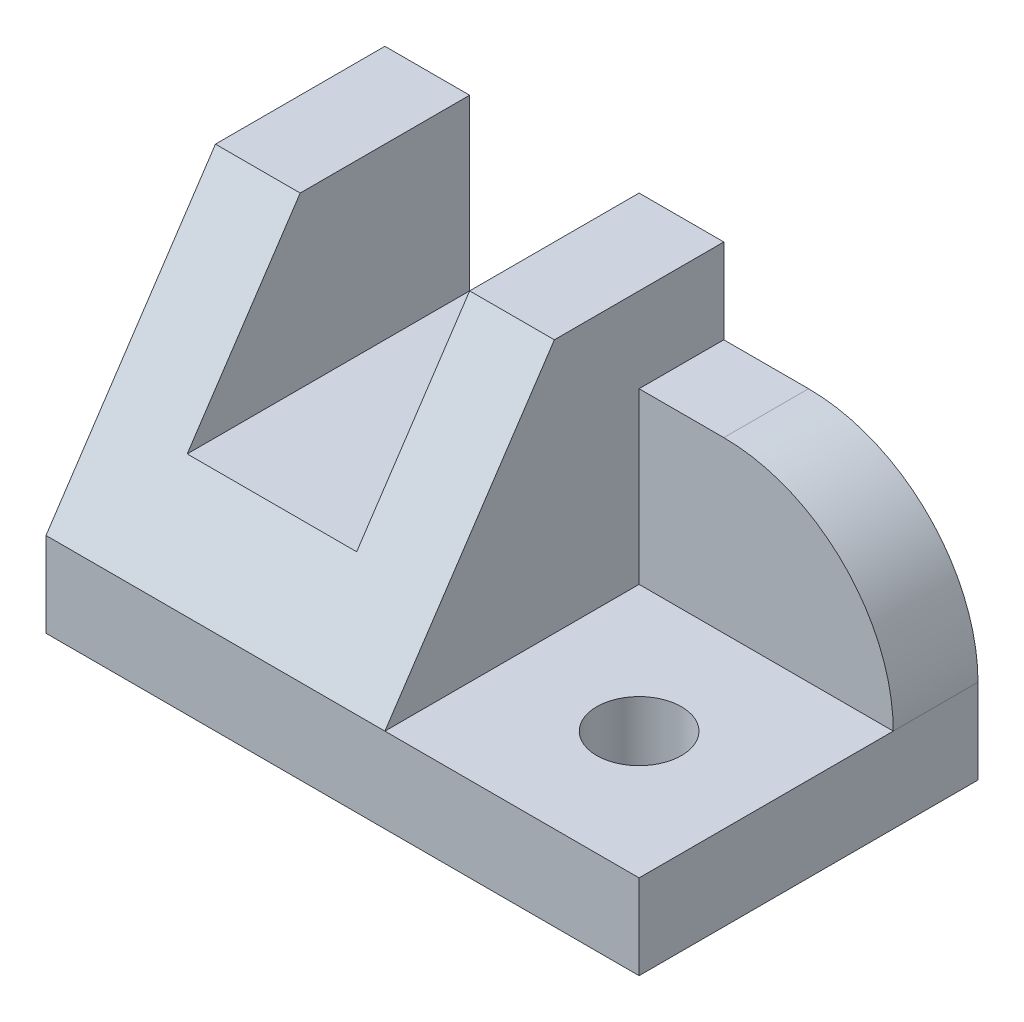
ISO-10303-21;
HEADER;
FILE_DESCRIPTION(('STEP AP214'),'2;1');
FILE_NAME('part.step','',(''),(''),'','','');
FILE_SCHEMA(('AUTOMOTIVE_DESIGN { 1 0 10303 214 1 1 1 1 }'));
ENDSEC;
DATA;
#1=APPLICATION_CONTEXT('core data for automotive mechanical design processes');
#2=APPLICATION_PROTOCOL_DEFINITION('international standard','automotive_design',2000,#1);
#3=PRODUCT_CONTEXT('',#1,'mechanical');
#4=PRODUCT('Part','Part','',(#3));
#5=PRODUCT_RELATED_PRODUCT_CATEGORY('part','',(#4));
#6=PRODUCT_DEFINITION_FORMATION('','',#4);
#7=PRODUCT_DEFINITION_CONTEXT('part definition',#1,'design');
#8=PRODUCT_DEFINITION('design','',#6,#7);
#9=PRODUCT_DEFINITION_SHAPE('','',#8);
#10=(LENGTH_UNIT() NAMED_UNIT(*) SI_UNIT(.MILLI.,.METRE.));
#11=(NAMED_UNIT(*) PLANE_ANGLE_UNIT() SI_UNIT($,.RADIAN.));
#12=(NAMED_UNIT(*) SI_UNIT($,.STERADIAN.) SOLID_ANGLE_UNIT());
#13=UNCERTAINTY_MEASURE_WITH_UNIT(LENGTH_MEASURE(1.E-05),#10,'distance_accuracy_value','');
#14=(GEOMETRIC_REPRESENTATION_CONTEXT(3) GLOBAL_UNCERTAINTY_ASSIGNED_CONTEXT((#13)) GLOBAL_UNIT_ASSIGNED_CONTEXT((#10,
#11,#12)) REPRESENTATION_CONTEXT('',''));
#15=CARTESIAN_POINT('',(0.,0.,0.));
#16=DIRECTION('',(0.,0.,1.));
#17=DIRECTION('',(1.,0.,0.));
#18=AXIS2_PLACEMENT_3D('',#15,#16,#17);
#19=CARTESIAN_POINT('',(-2.09339488942264,9.29069673517625,-1.19885004433804));
#20=DIRECTION('',(0.,1.,0.));
#21=DIRECTION('',(0.,0.,1.));
#22=AXIS2_PLACEMENT_3D('',#19,#20,#21);
#23=PLANE('',#22);
#24=DIRECTION('',(0.,0.,-1.));
#25=VECTOR('',#24,1.);
#26=CARTESIAN_POINT('',(-2.59339488942264,9.29069673517625,0.801149955661958));
#27=LINE('',#26,#25);
#28=CARTESIAN_POINT('',(-2.59339488942264,9.29069673517625,-1.19885004433804));
#29=VERTEX_POINT('',#28);
#30=CARTESIAN_POINT('',(-2.59339488942264,9.29069673517625,-3.19885004433804));
#31=VERTEX_POINT('',#30);
#32=EDGE_CURVE('E149',#29,#31,#27,.T.);
#33=ORIENTED_EDGE('',*,*,#32,.F.);
#34=DIRECTION('',(1.,0.,0.));
#35=VECTOR('',#34,1.);
#36=CARTESIAN_POINT('',(-5.59339488942264,9.29069673517625,-1.19885004433804));
#37=LINE('',#36,#35);
#38=CARTESIAN_POINT('',(-1.59339488942264,9.29069673517625,-1.19885004433804));
#39=VERTEX_POINT('',#38);
#40=EDGE_CURVE('E173',#29,#39,#37,.T.);
#41=ORIENTED_EDGE('',*,*,#40,.T.);
#42=DIRECTION('',(0.,0.,1.));
#43=VECTOR('',#42,1.);
#44=CARTESIAN_POINT('',(-1.59339488942264,9.29069673517625,-1.19885004433804));
#45=LINE('',#44,#43);
#46=CARTESIAN_POINT('',(-1.59339488942264,9.29069673517625,-3.19885004433804));
#47=VERTEX_POINT('',#46);
#48=EDGE_CURVE('E175',#47,#39,#45,.T.);
#49=ORIENTED_EDGE('',*,*,#48,.F.);
#50=DIRECTION('',(1.,0.,0.));
#51=VECTOR('',#50,1.);
#52=CARTESIAN_POINT('',(-2.09339488942264,9.29069673517625,-3.19885004433804));
#53=LINE('',#52,#51);
#54=EDGE_CURVE('E178',#31,#47,#53,.T.);
#55=ORIENTED_EDGE('',*,*,#54,.F.);
#56=EDGE_LOOP('',(#33,#41,#49,#55));
#57=FACE_BOUND('',#56,.T.);
#58=ADVANCED_FACE('F38',(#57),#23,.T.);
#59=CARTESIAN_POINT('',(-2.09339488942264,6.29069673517625,0.801149955661958));
#60=DIRECTION('',(0.,0.,-1.));
#61=DIRECTION('',(-1.,0.,0.));
#62=AXIS2_PLACEMENT_3D('',#59,#60,#61);
#63=PLANE('',#62);
#64=DIRECTION('',(1.,0.,0.));
#65=VECTOR('',#64,1.);
#66=CARTESIAN_POINT('',(-2.09339488942264,6.29069673517625,0.801149955661958));
#67=LINE('',#66,#65);
#68=CARTESIAN_POINT('',(-1.59339488942264,6.29069673517625,0.801149955661958));
#69=VERTEX_POINT('',#68);
#70=CARTESIAN_POINT('',(1.40660511057736,6.29069673517625,0.801149955661958));
#71=VERTEX_POINT('',#70);
#72=EDGE_CURVE('E220',#69,#71,#67,.T.);
#73=ORIENTED_EDGE('',*,*,#72,.F.);
#74=DIRECTION('',(1.,0.,0.));
#75=VECTOR('',#74,1.);
#76=CARTESIAN_POINT('',(-5.59339488942264,6.29069673517625,0.801149955661958));
#77=LINE('',#76,#75);
#78=CARTESIAN_POINT('',(-5.59339488942264,6.29069673517625,0.801149955661958));
#79=VERTEX_POINT('',#78);
#80=EDGE_CURVE('E166',#79,#69,#77,.T.);
#81=ORIENTED_EDGE('',*,*,#80,.F.);
#82=DIRECTION('',(0.,-1.,0.));
#83=VECTOR('',#82,1.);
#84=CARTESIAN_POINT('',(-5.59339488942264,9.29069673517625,0.801149955661958));
#85=LINE('',#84,#83);
#86=CARTESIAN_POINT('',(-5.59339488942264,5.29069673517625,0.801149955661958));
#87=VERTEX_POINT('',#86);
#88=EDGE_CURVE('E183',#79,#87,#85,.T.);
#89=ORIENTED_EDGE('',*,*,#88,.T.);
#90=DIRECTION('',(1.,0.,0.));
#91=VECTOR('',#90,1.);
#92=CARTESIAN_POINT('',(-2.09339488942264,5.29069673517625,0.801149955661958));
#93=LINE('',#92,#91);
#94=CARTESIAN_POINT('',(1.40660511057736,5.29069673517625,0.801149955661958));
#95=VERTEX_POINT('',#94);
#96=EDGE_CURVE('E229',#87,#95,#93,.T.);
#97=ORIENTED_EDGE('',*,*,#96,.T.);
#98=DIRECTION('',(0.,-1.,0.));
#99=VECTOR('',#98,1.);
#100=CARTESIAN_POINT('',(1.40660511057736,6.29069673517625,0.801149955661958));
#101=LINE('',#100,#99);
#102=EDGE_CURVE('E226',#71,#95,#101,.T.);
#103=ORIENTED_EDGE('',*,*,#102,.F.);
#104=EDGE_LOOP('',(#73,#81,#89,#97,#103));
#105=FACE_BOUND('',#104,.T.);
#106=ADVANCED_FACE('F269',(#105),#63,.F.);
#107=CARTESIAN_POINT('',(-0.0933948894226384,6.29069673517625,-0.698850044338042));
#108=DIRECTION('',(0.,-1.,0.));
#109=DIRECTION('',(0.,0.,-1.));
#110=AXIS2_PLACEMENT_3D('',#107,#108,#109);
#111=CYLINDRICAL_SURFACE('',#110,0.5);
#112=CARTESIAN_POINT('',(-0.0933948894226384,6.29069673517625,-0.698850044338042));
#113=DIRECTION('',(0.,1.,0.));
#114=DIRECTION('',(0.,0.,1.));
#115=AXIS2_PLACEMENT_3D('',#112,#113,#114);
#116=CIRCLE('',#115,0.5);
#117=CARTESIAN_POINT('',(-0.0933948894226384,6.29069673517625,-0.198850044338042));
#118=VERTEX_POINT('',#117);
#119=EDGE_CURVE('E210',#118,#118,#116,.T.);
#120=ORIENTED_EDGE('',*,*,#119,.T.);
#121=EDGE_LOOP('',(#120));
#122=FACE_BOUND('',#121,.T.);
#123=CARTESIAN_POINT('',(-0.0933948894226384,5.29069673517625,-0.698850044338042));
#124=DIRECTION('',(0.,1.,0.));
#125=DIRECTION('',(0.,0.,1.));
#126=AXIS2_PLACEMENT_3D('',#123,#124,#125);
#127=CIRCLE('',#126,0.5);
#128=CARTESIAN_POINT('',(-0.0933948894226384,5.29069673517625,-0.198850044338042));
#129=VERTEX_POINT('',#128);
#130=EDGE_CURVE('E209',#129,#129,#127,.T.);
#131=ORIENTED_EDGE('',*,*,#130,.F.);
#132=EDGE_LOOP('',(#131));
#133=FACE_BOUND('',#132,.T.);
#134=ADVANCED_FACE('F298',(#122,#133),#111,.F.);
#135=CARTESIAN_POINT('',(1.40660511057736,6.29069673517625,-1.19885004433804));
#136=DIRECTION('',(-1.,0.,0.));
#137=DIRECTION('',(0.,0.,1.));
#138=AXIS2_PLACEMENT_3D('',#135,#136,#137);
#139=PLANE('',#138);
#140=DIRECTION('',(0.,-1.,0.));
#141=VECTOR('',#140,1.);
#142=CARTESIAN_POINT('',(1.40660511057736,8.29069673517624,-3.19885004433804));
#143=LINE('',#142,#141);
#144=CARTESIAN_POINT('',(1.40660511057736,6.29069673517625,-3.19885004433804));
#145=VERTEX_POINT('',#144);
#146=CARTESIAN_POINT('',(1.40660511057736,5.29069673517625,-3.19885004433804));
#147=VERTEX_POINT('',#146);
#148=EDGE_CURVE('E202',#145,#147,#143,.T.);
#149=ORIENTED_EDGE('',*,*,#148,.F.);
#150=DIRECTION('',(0.,0.,-1.));
#151=VECTOR('',#150,1.);
#152=CARTESIAN_POINT('',(1.40660511057736,6.29069673517625,-2.19885004433804));
#153=LINE('',#152,#151);
#154=CARTESIAN_POINT('',(1.40660511057736,6.29069673517625,-2.19885004433804));
#155=VERTEX_POINT('',#154);
#156=EDGE_CURVE('E46',#145,#155,#153,.F.);
#157=ORIENTED_EDGE('',*,*,#156,.T.);
#158=DIRECTION('',(0.,0.,-1.));
#159=VECTOR('',#158,1.);
#160=CARTESIAN_POINT('',(1.40660511057736,6.29069673517625,-1.19885004433804));
#161=LINE('',#160,#159);
#162=EDGE_CURVE('E223',#71,#155,#161,.T.);
#163=ORIENTED_EDGE('',*,*,#162,.F.);
#164=ORIENTED_EDGE('',*,*,#102,.T.);
#165=DIRECTION('',(0.,0.,-1.));
#166=VECTOR('',#165,1.);
#167=CARTESIAN_POINT('',(1.40660511057736,5.29069673517625,-1.19885004433804));
#168=LINE('',#167,#166);
#169=EDGE_CURVE('E214',#95,#147,#168,.T.);
#170=ORIENTED_EDGE('',*,*,#169,.T.);
#171=EDGE_LOOP('',(#149,#157,#163,#164,#170));
#172=FACE_BOUND('',#171,.T.);
#173=ADVANCED_FACE('F245',(#172),#139,.F.);
#174=CARTESIAN_POINT('',(-2.09339488942264,6.29069673517625,-1.19885004433804));
#175=DIRECTION('',(0.,1.,0.));
#176=DIRECTION('',(0.,0.,1.));
#177=AXIS2_PLACEMENT_3D('',#174,#175,#176);
#178=PLANE('',#177);
#179=ORIENTED_EDGE('',*,*,#119,.F.);
#180=EDGE_LOOP('',(#179));
#181=FACE_BOUND('',#180,.T.);
#182=DIRECTION('',(1.,0.,0.));
#183=VECTOR('',#182,1.);
#184=CARTESIAN_POINT('',(-2.09339488942264,6.29069673517625,-2.19885004433804));
#185=LINE('',#184,#183);
#186=CARTESIAN_POINT('',(-1.59339488942264,6.29069673517625,-2.19885004433804));
#187=VERTEX_POINT('',#186);
#188=EDGE_CURVE('E213',#187,#155,#185,.T.);
#189=ORIENTED_EDGE('',*,*,#188,.F.);
#190=DIRECTION('',(0.,0.,1.));
#191=VECTOR('',#190,1.);
#192=CARTESIAN_POINT('',(-1.59339488942264,6.29069673517625,-1.19885004433804));
#193=LINE('',#192,#191);
#194=EDGE_CURVE('E217',#187,#69,#193,.T.);
#195=ORIENTED_EDGE('',*,*,#194,.T.);
#196=ORIENTED_EDGE('',*,*,#72,.T.);
#197=ORIENTED_EDGE('',*,*,#162,.T.);
#198=EDGE_LOOP('',(#189,#195,#196,#197));
#199=FACE_BOUND('',#198,.T.);
#200=ADVANCED_FACE('F249',(#181,#199),#178,.T.);
#201=CARTESIAN_POINT('',(-2.09339488942264,5.29069673517625,-1.19885004433804));
#202=DIRECTION('',(0.,1.,0.));
#203=DIRECTION('',(0.,0.,1.));
#204=AXIS2_PLACEMENT_3D('',#201,#202,#203);
#205=PLANE('',#204);
#206=ORIENTED_EDGE('',*,*,#130,.T.);
#207=EDGE_LOOP('',(#206));
#208=FACE_BOUND('',#207,.T.);
#209=ORIENTED_EDGE('',*,*,#96,.F.);
#210=DIRECTION('',(0.,0.,-1.));
#211=VECTOR('',#210,1.);
#212=CARTESIAN_POINT('',(-5.59339488942264,5.29069673517625,-1.19885004433804));
#213=LINE('',#212,#211);
#214=CARTESIAN_POINT('',(-5.59339488942264,5.29069673517625,-3.19885004433804));
#215=VERTEX_POINT('',#214);
#216=EDGE_CURVE('E172',#87,#215,#213,.T.);
#217=ORIENTED_EDGE('',*,*,#216,.T.);
#218=DIRECTION('',(1.,0.,0.));
#219=VECTOR('',#218,1.);
#220=CARTESIAN_POINT('',(-2.09339488942264,5.29069673517625,-3.19885004433804));
#221=LINE('',#220,#219);
#222=EDGE_CURVE('E193',#215,#147,#221,.T.);
#223=ORIENTED_EDGE('',*,*,#222,.T.);
#224=ORIENTED_EDGE('',*,*,#169,.F.);
#225=EDGE_LOOP('',(#209,#217,#223,#224));
#226=FACE_BOUND('',#225,.T.);
#227=ADVANCED_FACE('F273',(#208,#226),#205,.F.);
#228=CARTESIAN_POINT('',(-2.09339488942264,8.29069673517624,-2.19885004433804));
#229=DIRECTION('',(0.,0.,-1.));
#230=DIRECTION('',(-1.,0.,0.));
#231=AXIS2_PLACEMENT_3D('',#228,#229,#230);
#232=PLANE('',#231);
#233=ORIENTED_EDGE('',*,*,#188,.T.);
#234=CARTESIAN_POINT('',(-0.593394889422639,6.29069673517625,-2.19885004433804));
#235=DIRECTION('',(0.,0.,-1.));
#236=DIRECTION('',(-1.,0.,0.));
#237=AXIS2_PLACEMENT_3D('',#234,#235,#236);
#238=CIRCLE('',#237,2.);
#239=CARTESIAN_POINT('',(-0.593394889422639,8.29069673517624,-2.19885004433804));
#240=VERTEX_POINT('',#239);
#241=EDGE_CURVE('E11',#155,#240,#238,.F.);
#242=ORIENTED_EDGE('',*,*,#241,.T.);
#243=DIRECTION('',(1.,0.,0.));
#244=VECTOR('',#243,1.);
#245=CARTESIAN_POINT('',(-2.09339488942264,8.29069673517624,-2.19885004433804));
#246=LINE('',#245,#244);
#247=CARTESIAN_POINT('',(-1.59339488942264,8.29069673517624,-2.19885004433804));
#248=VERTEX_POINT('',#247);
#249=EDGE_CURVE('E197',#248,#240,#246,.T.);
#250=ORIENTED_EDGE('',*,*,#249,.F.);
#251=DIRECTION('',(0.,-1.,0.));
#252=VECTOR('',#251,1.);
#253=CARTESIAN_POINT('',(-1.59339488942264,8.29069673517624,-2.19885004433804));
#254=LINE('',#253,#252);
#255=EDGE_CURVE('E206',#248,#187,#254,.T.);
#256=ORIENTED_EDGE('',*,*,#255,.T.);
#257=EDGE_LOOP('',(#233,#242,#250,#256));
#258=FACE_BOUND('',#257,.T.);
#259=ADVANCED_FACE('F253',(#258),#232,.F.);
#260=CARTESIAN_POINT('',(-2.09339488942264,8.29069673517624,-3.19885004433804));
#261=DIRECTION('',(0.,0.,-1.));
#262=DIRECTION('',(-1.,0.,0.));
#263=AXIS2_PLACEMENT_3D('',#260,#261,#262);
#264=PLANE('',#263);
#265=DIRECTION('',(1.,0.,0.));
#266=VECTOR('',#265,1.);
#267=CARTESIAN_POINT('',(-2.09339488942264,8.29069673517624,-3.19885004433804));
#268=LINE('',#267,#266);
#269=CARTESIAN_POINT('',(-1.59339488942264,8.29069673517624,-3.19885004433804));
#270=VERTEX_POINT('',#269);
#271=CARTESIAN_POINT('',(-0.593394889422639,8.29069673517624,-3.19885004433804));
#272=VERTEX_POINT('',#271);
#273=EDGE_CURVE('E200',#270,#272,#268,.T.);
#274=ORIENTED_EDGE('',*,*,#273,.T.);
#275=CARTESIAN_POINT('',(-0.593394889422639,6.29069673517625,-3.19885004433804));
#276=DIRECTION('',(0.,0.,-1.));
#277=DIRECTION('',(-1.,0.,0.));
#278=AXIS2_PLACEMENT_3D('',#275,#276,#277);
#279=CIRCLE('',#278,2.);
#280=EDGE_CURVE('E53',#272,#145,#279,.T.);
#281=ORIENTED_EDGE('',*,*,#280,.T.);
#282=ORIENTED_EDGE('',*,*,#148,.T.);
#283=ORIENTED_EDGE('',*,*,#222,.F.);
#284=DIRECTION('',(0.,-1.,0.));
#285=VECTOR('',#284,1.);
#286=CARTESIAN_POINT('',(-5.59339488942264,9.29069673517625,-3.19885004433804));
#287=LINE('',#286,#285);
#288=CARTESIAN_POINT('',(-5.59339488942264,9.29069673517625,-3.19885004433804));
#289=VERTEX_POINT('',#288);
#290=EDGE_CURVE('E187',#289,#215,#287,.T.);
#291=ORIENTED_EDGE('',*,*,#290,.F.);
#292=CARTESIAN_POINT('',(-4.59339488942264,9.29069673517625,-3.19885004433804));
#293=VERTEX_POINT('',#292);
#294=EDGE_CURVE('E179',#289,#293,#53,.T.);
#295=ORIENTED_EDGE('',*,*,#294,.T.);
#296=DIRECTION('',(0.,1.,0.));
#297=VECTOR('',#296,1.);
#298=CARTESIAN_POINT('',(-4.59339488942264,9.29069673517625,-3.19885004433804));
#299=LINE('',#298,#297);
#300=CARTESIAN_POINT('',(-4.59339488942264,7.29069673517625,-3.19885004433804));
#301=VERTEX_POINT('',#300);
#302=EDGE_CURVE('E143',#301,#293,#299,.T.);
#303=ORIENTED_EDGE('',*,*,#302,.F.);
#304=DIRECTION('',(-1.,0.,0.));
#305=VECTOR('',#304,1.);
#306=CARTESIAN_POINT('',(-2.59339488942264,7.29069673517625,-3.19885004433804));
#307=LINE('',#306,#305);
#308=CARTESIAN_POINT('',(-2.59339488942264,7.29069673517625,-3.19885004433804));
#309=VERTEX_POINT('',#308);
#310=EDGE_CURVE('E136',#309,#301,#307,.T.);
#311=ORIENTED_EDGE('',*,*,#310,.F.);
#312=DIRECTION('',(0.,-1.,0.));
#313=VECTOR('',#312,1.);
#314=CARTESIAN_POINT('',(-2.59339488942264,9.29069673517625,-3.19885004433804));
#315=LINE('',#314,#313);
#316=EDGE_CURVE('E146',#31,#309,#315,.T.);
#317=ORIENTED_EDGE('',*,*,#316,.F.);
#318=ORIENTED_EDGE('',*,*,#54,.T.);
#319=DIRECTION('',(0.,-1.,0.));
#320=VECTOR('',#319,1.);
#321=CARTESIAN_POINT('',(-1.59339488942264,9.29069673517625,-3.19885004433804));
#322=LINE('',#321,#320);
#323=EDGE_CURVE('E190',#47,#270,#322,.T.);
#324=ORIENTED_EDGE('',*,*,#323,.T.);
#325=EDGE_LOOP('',(#274,#281,#282,#283,#291,#295,#303,#311,#317,#318,#324));
#326=FACE_BOUND('',#325,.T.);
#327=ADVANCED_FACE('F152',(#326),#264,.T.);
#328=CARTESIAN_POINT('',(-2.09339488942264,8.29069673517624,-1.19885004433804));
#329=DIRECTION('',(0.,1.,0.));
#330=DIRECTION('',(0.,0.,1.));
#331=AXIS2_PLACEMENT_3D('',#328,#329,#330);
#332=PLANE('',#331);
#333=ORIENTED_EDGE('',*,*,#249,.T.);
#334=DIRECTION('',(0.,0.,-1.));
#335=VECTOR('',#334,1.);
#336=CARTESIAN_POINT('',(-0.593394889422639,8.29069673517624,-3.19885004433804));
#337=LINE('',#336,#335);
#338=EDGE_CURVE('E242',#240,#272,#337,.T.);
#339=ORIENTED_EDGE('',*,*,#338,.T.);
#340=ORIENTED_EDGE('',*,*,#273,.F.);
#341=DIRECTION('',(0.,0.,1.));
#342=VECTOR('',#341,1.);
#343=CARTESIAN_POINT('',(-1.59339488942264,8.29069673517624,-1.19885004433804));
#344=LINE('',#343,#342);
#345=EDGE_CURVE('E194',#270,#248,#344,.T.);
#346=ORIENTED_EDGE('',*,*,#345,.T.);
#347=EDGE_LOOP('',(#333,#339,#340,#346));
#348=FACE_BOUND('',#347,.T.);
#349=ADVANCED_FACE('F257',(#348),#332,.T.);
#350=CARTESIAN_POINT('',(-1.59339488942264,9.29069673517625,-1.19885004433804));
#351=DIRECTION('',(1.,0.,0.));
#352=DIRECTION('',(0.,0.,-1.));
#353=AXIS2_PLACEMENT_3D('',#350,#351,#352);
#354=PLANE('',#353);
#355=DIRECTION('',(0.,0.832050294337844,-0.554700196225229));
#356=VECTOR('',#355,1.);
#357=CARTESIAN_POINT('',(-1.59339488942264,6.29069673517625,0.801149955661958));
#358=LINE('',#357,#356);
#359=EDGE_CURVE('E158',#69,#39,#358,.T.);
#360=ORIENTED_EDGE('',*,*,#359,.F.);
#361=ORIENTED_EDGE('',*,*,#194,.F.);
#362=ORIENTED_EDGE('',*,*,#255,.F.);
#363=ORIENTED_EDGE('',*,*,#345,.F.);
#364=ORIENTED_EDGE('',*,*,#323,.F.);
#365=ORIENTED_EDGE('',*,*,#48,.T.);
#366=EDGE_LOOP('',(#360,#361,#362,#363,#364,#365));
#367=FACE_BOUND('',#366,.T.);
#368=ADVANCED_FACE('F262',(#367),#354,.T.);
#369=CARTESIAN_POINT('',(-5.59339488942264,9.29069673517625,-1.19885004433804));
#370=DIRECTION('',(-1.,0.,0.));
#371=DIRECTION('',(0.,0.,1.));
#372=AXIS2_PLACEMENT_3D('',#369,#370,#371);
#373=PLANE('',#372);
#374=DIRECTION('',(0.,0.832050294337844,-0.554700196225229));
#375=VECTOR('',#374,1.);
#376=CARTESIAN_POINT('',(-5.59339488942264,6.29069673517625,0.801149955661958));
#377=LINE('',#376,#375);
#378=CARTESIAN_POINT('',(-5.59339488942264,9.29069673517625,-1.19885004433804));
#379=VERTEX_POINT('',#378);
#380=EDGE_CURVE('E163',#79,#379,#377,.T.);
#381=ORIENTED_EDGE('',*,*,#380,.T.);
#382=DIRECTION('',(0.,0.,-1.));
#383=VECTOR('',#382,1.);
#384=CARTESIAN_POINT('',(-5.59339488942264,9.29069673517625,-1.19885004433804));
#385=LINE('',#384,#383);
#386=EDGE_CURVE('E181',#379,#289,#385,.T.);
#387=ORIENTED_EDGE('',*,*,#386,.T.);
#388=ORIENTED_EDGE('',*,*,#290,.T.);
#389=ORIENTED_EDGE('',*,*,#216,.F.);
#390=ORIENTED_EDGE('',*,*,#88,.F.);
#391=EDGE_LOOP('',(#381,#387,#388,#389,#390));
#392=FACE_BOUND('',#391,.T.);
#393=ADVANCED_FACE('F278',(#392),#373,.T.);
#394=DIRECTION('',(0.,0.,-1.));
#395=VECTOR('',#394,1.);
#396=CARTESIAN_POINT('',(-4.59339488942264,9.29069673517625,0.801149955661958));
#397=LINE('',#396,#395);
#398=CARTESIAN_POINT('',(-4.59339488942264,9.29069673517625,-1.19885004433804));
#399=VERTEX_POINT('',#398);
#400=EDGE_CURVE('E159',#399,#293,#397,.T.);
#401=ORIENTED_EDGE('',*,*,#400,.T.);
#402=ORIENTED_EDGE('',*,*,#294,.F.);
#403=ORIENTED_EDGE('',*,*,#386,.F.);
#404=EDGE_CURVE('E169',#379,#399,#37,.T.);
#405=ORIENTED_EDGE('',*,*,#404,.T.);
#406=EDGE_LOOP('',(#401,#402,#403,#405));
#407=FACE_BOUND('',#406,.T.);
#408=ADVANCED_FACE('F281',(#407),#23,.T.);
#409=CARTESIAN_POINT('',(-5.59339488942264,6.29069673517625,0.801149955661958));
#410=DIRECTION('',(0.,-0.554700196225229,-0.832050294337844));
#411=DIRECTION('',(0.,0.832050294337844,-0.554700196225229));
#412=AXIS2_PLACEMENT_3D('',#409,#410,#411);
#413=PLANE('',#412);
#414=ORIENTED_EDGE('',*,*,#40,.F.);
#415=DIRECTION('',(0.,-0.832050294337844,0.554700196225229));
#416=VECTOR('',#415,1.);
#417=CARTESIAN_POINT('',(-2.59339488942264,6.29069673517625,0.801149955661958));
#418=LINE('',#417,#416);
#419=CARTESIAN_POINT('',(-2.59339488942264,7.29069673517625,0.134483288995291));
#420=VERTEX_POINT('',#419);
#421=EDGE_CURVE('E240',#29,#420,#418,.T.);
#422=ORIENTED_EDGE('',*,*,#421,.T.);
#423=DIRECTION('',(-1.,0.,0.));
#424=VECTOR('',#423,1.);
#425=CARTESIAN_POINT('',(-5.59339488942264,7.29069673517625,0.134483288995291));
#426=LINE('',#425,#424);
#427=CARTESIAN_POINT('',(-4.59339488942264,7.29069673517625,0.134483288995291));
#428=VERTEX_POINT('',#427);
#429=EDGE_CURVE('E139',#420,#428,#426,.T.);
#430=ORIENTED_EDGE('',*,*,#429,.T.);
#431=DIRECTION('',(0.,0.832050294337844,-0.554700196225229));
#432=VECTOR('',#431,1.);
#433=CARTESIAN_POINT('',(-4.59339488942264,6.29069673517625,0.801149955661958));
#434=LINE('',#433,#432);
#435=EDGE_CURVE('E237',#428,#399,#434,.T.);
#436=ORIENTED_EDGE('',*,*,#435,.T.);
#437=ORIENTED_EDGE('',*,*,#404,.F.);
#438=ORIENTED_EDGE('',*,*,#380,.F.);
#439=ORIENTED_EDGE('',*,*,#80,.T.);
#440=ORIENTED_EDGE('',*,*,#359,.T.);
#441=EDGE_LOOP('',(#414,#422,#430,#436,#437,#438,#439,#440));
#442=FACE_BOUND('',#441,.T.);
#443=ADVANCED_FACE('F266',(#442),#413,.F.);
#444=CARTESIAN_POINT('',(-2.59339488942264,9.29069673517625,0.801149955661958));
#445=DIRECTION('',(1.,0.,0.));
#446=DIRECTION('',(0.,1.,0.));
#447=AXIS2_PLACEMENT_3D('',#444,#445,#446);
#448=PLANE('',#447);
#449=ORIENTED_EDGE('',*,*,#32,.T.);
#450=ORIENTED_EDGE('',*,*,#316,.T.);
#451=DIRECTION('',(0.,0.,-1.));
#452=VECTOR('',#451,1.);
#453=CARTESIAN_POINT('',(-2.59339488942264,7.29069673517625,0.801149955661958));
#454=LINE('',#453,#452);
#455=EDGE_CURVE('E132',#420,#309,#454,.T.);
#456=ORIENTED_EDGE('',*,*,#455,.F.);
#457=ORIENTED_EDGE('',*,*,#421,.F.);
#458=EDGE_LOOP('',(#449,#450,#456,#457));
#459=FACE_BOUND('',#458,.T.);
#460=ADVANCED_FACE('F147',(#459),#448,.F.);
#461=CARTESIAN_POINT('',(-4.59339488942264,9.29069673517625,0.801149955661958));
#462=DIRECTION('',(-1.,0.,0.));
#463=DIRECTION('',(0.,-1.,0.));
#464=AXIS2_PLACEMENT_3D('',#461,#462,#463);
#465=PLANE('',#464);
#466=DIRECTION('',(0.,0.,-1.));
#467=VECTOR('',#466,1.);
#468=CARTESIAN_POINT('',(-4.59339488942264,7.29069673517625,0.801149955661958));
#469=LINE('',#468,#467);
#470=EDGE_CURVE('E142',#428,#301,#469,.T.);
#471=ORIENTED_EDGE('',*,*,#470,.T.);
#472=ORIENTED_EDGE('',*,*,#302,.T.);
#473=ORIENTED_EDGE('',*,*,#400,.F.);
#474=ORIENTED_EDGE('',*,*,#435,.F.);
#475=EDGE_LOOP('',(#471,#472,#473,#474));
#476=FACE_BOUND('',#475,.T.);
#477=ADVANCED_FACE('F284',(#476),#465,.F.);
#478=CARTESIAN_POINT('',(-2.59339488942264,7.29069673517625,0.801149955661958));
#479=DIRECTION('',(0.,-1.,0.));
#480=DIRECTION('',(0.,0.,-1.));
#481=AXIS2_PLACEMENT_3D('',#478,#479,#480);
#482=PLANE('',#481);
#483=ORIENTED_EDGE('',*,*,#455,.T.);
#484=ORIENTED_EDGE('',*,*,#310,.T.);
#485=ORIENTED_EDGE('',*,*,#470,.F.);
#486=ORIENTED_EDGE('',*,*,#429,.F.);
#487=EDGE_LOOP('',(#483,#484,#485,#486));
#488=FACE_BOUND('',#487,.T.);
#489=ADVANCED_FACE('F134',(#488),#482,.F.);
#490=CARTESIAN_POINT('',(-0.593394889422639,6.29069673517625,-1.19885004433804));
#491=DIRECTION('',(0.,0.,1.));
#492=DIRECTION('',(1.,0.,0.));
#493=AXIS2_PLACEMENT_3D('',#490,#491,#492);
#494=CYLINDRICAL_SURFACE('',#493,2.);
#495=ORIENTED_EDGE('',*,*,#241,.F.);
#496=ORIENTED_EDGE('',*,*,#156,.F.);
#497=ORIENTED_EDGE('',*,*,#280,.F.);
#498=ORIENTED_EDGE('',*,*,#338,.F.);
#499=EDGE_LOOP('',(#495,#496,#497,#498));
#500=FACE_BOUND('',#499,.T.);
#501=ADVANCED_FACE('F40',(#500),#494,.T.);
#502=CLOSED_SHELL('',(#58,#106,#134,#173,#200,#227,#259,#327,#349,#368,#393,#408,#443,#460,#477,
#489,#501));
#503=MANIFOLD_SOLID_BREP('B2',#502);
#504=ADVANCED_BREP_SHAPE_REPRESENTATION('',(#18,#503),#14);
#505=SHAPE_DEFINITION_REPRESENTATION(#9,#504);
ENDSEC;
END-ISO-10303-21;
